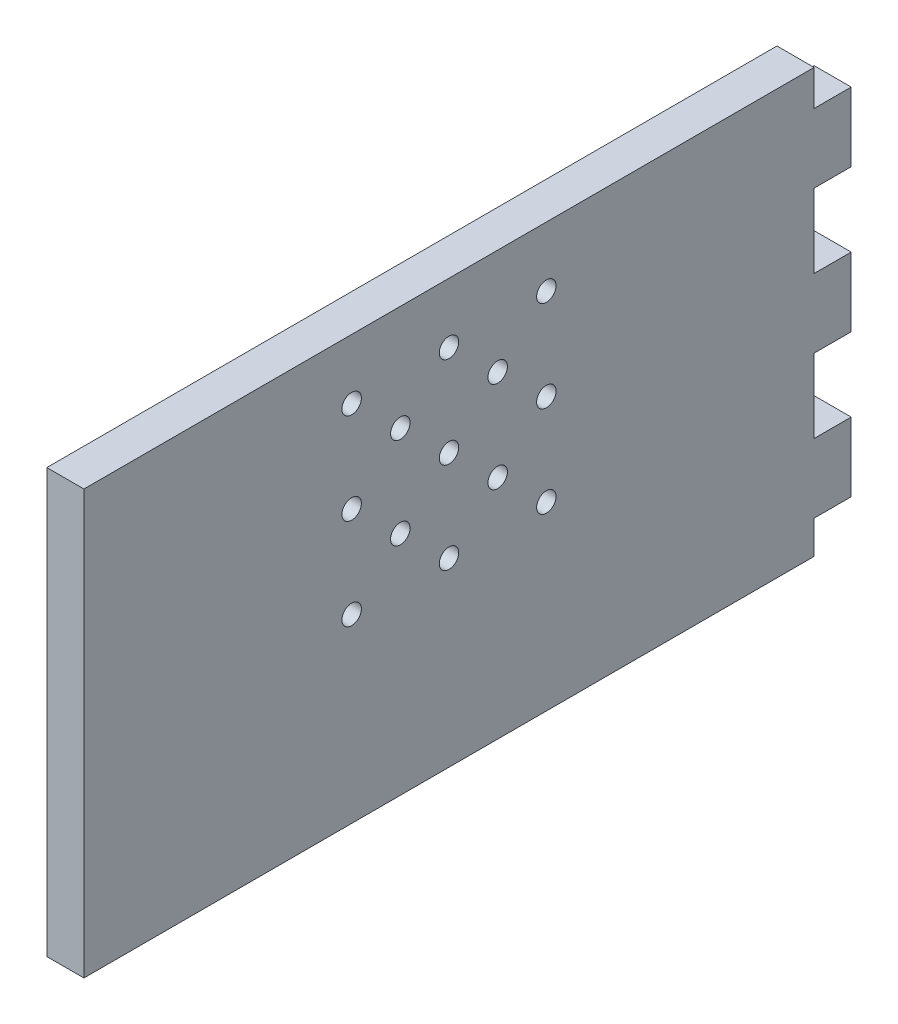
ISO-10303-21;
HEADER;
FILE_DESCRIPTION(('STEP AP214'),'2;1');
FILE_NAME('part.step','',(''),(''),'','','');
FILE_SCHEMA(('AUTOMOTIVE_DESIGN { 1 0 10303 214 1 1 1 1 }'));
ENDSEC;
DATA;
#1=APPLICATION_CONTEXT('core data for automotive mechanical design processes');
#2=APPLICATION_PROTOCOL_DEFINITION('international standard','automotive_design',2000,#1);
#3=PRODUCT_CONTEXT('',#1,'mechanical');
#4=PRODUCT('Part','Part','',(#3));
#5=PRODUCT_RELATED_PRODUCT_CATEGORY('part','',(#4));
#6=PRODUCT_DEFINITION_FORMATION('','',#4);
#7=PRODUCT_DEFINITION_CONTEXT('part definition',#1,'design');
#8=PRODUCT_DEFINITION('design','',#6,#7);
#9=PRODUCT_DEFINITION_SHAPE('','',#8);
#10=(LENGTH_UNIT() NAMED_UNIT(*) SI_UNIT(.MILLI.,.METRE.));
#11=(NAMED_UNIT(*) PLANE_ANGLE_UNIT() SI_UNIT($,.RADIAN.));
#12=(NAMED_UNIT(*) SI_UNIT($,.STERADIAN.) SOLID_ANGLE_UNIT());
#13=UNCERTAINTY_MEASURE_WITH_UNIT(LENGTH_MEASURE(1.E-05),#10,'distance_accuracy_value','');
#14=(GEOMETRIC_REPRESENTATION_CONTEXT(3) GLOBAL_UNCERTAINTY_ASSIGNED_CONTEXT((#13)) GLOBAL_UNIT_ASSIGNED_CONTEXT((#10,
#11,#12)) REPRESENTATION_CONTEXT('',''));
#15=CARTESIAN_POINT('',(0.,0.,0.));
#16=DIRECTION('',(0.,0.,1.));
#17=DIRECTION('',(1.,0.,0.));
#18=AXIS2_PLACEMENT_3D('',#15,#16,#17);
#19=CARTESIAN_POINT('',(0.,0.,0.));
#20=DIRECTION('',(0.,0.,-1.));
#21=DIRECTION('',(-1.,0.,0.));
#22=AXIS2_PLACEMENT_3D('',#19,#20,#21);
#23=PLANE('',#22);
#24=DIRECTION('',(1.,0.,0.));
#25=VECTOR('',#24,1.);
#26=CARTESIAN_POINT('',(450.,38.0281503431067,0.));
#27=LINE('',#26,#25);
#28=CARTESIAN_POINT('',(450.,38.0281503431067,0.));
#29=VERTEX_POINT('',#28);
#30=CARTESIAN_POINT('',(465.25,38.0281503431067,0.));
#31=VERTEX_POINT('',#30);
#32=EDGE_CURVE('E178',#29,#31,#27,.T.);
#33=ORIENTED_EDGE('',*,*,#32,.F.);
#34=DIRECTION('',(0.,-1.,0.));
#35=VECTOR('',#34,1.);
#36=CARTESIAN_POINT('',(450.,170.063864628821,0.));
#37=LINE('',#36,#35);
#38=CARTESIAN_POINT('',(450.,68.3852932002495,0.));
#39=VERTEX_POINT('',#38);
#40=EDGE_CURVE('E294',#39,#29,#37,.T.);
#41=ORIENTED_EDGE('',*,*,#40,.F.);
#42=DIRECTION('',(1.,0.,0.));
#43=VECTOR('',#42,1.);
#44=CARTESIAN_POINT('',(450.,68.3852932002495,0.));
#45=LINE('',#44,#43);
#46=CARTESIAN_POINT('',(465.25,68.3852932002495,0.));
#47=VERTEX_POINT('',#46);
#48=EDGE_CURVE('E190',#39,#47,#45,.T.);
#49=ORIENTED_EDGE('',*,*,#48,.T.);
#50=DIRECTION('',(0.,1.,0.));
#51=VECTOR('',#50,1.);
#52=CARTESIAN_POINT('',(465.25,170.063864628821,0.));
#53=LINE('',#52,#51);
#54=EDGE_CURVE('E242',#31,#47,#53,.T.);
#55=ORIENTED_EDGE('',*,*,#54,.F.);
#56=EDGE_LOOP('',(#33,#41,#49,#55));
#57=FACE_BOUND('',#56,.T.);
#58=ADVANCED_FACE('F34',(#57),#23,.T.);
#59=DIRECTION('',(1.,0.,0.));
#60=VECTOR('',#59,1.);
#61=CARTESIAN_POINT('',(450.,96.7424360573924,0.));
#62=LINE('',#61,#60);
#63=CARTESIAN_POINT('',(450.,96.7424360573924,0.));
#64=VERTEX_POINT('',#63);
#65=CARTESIAN_POINT('',(465.25,96.7424360573924,0.));
#66=VERTEX_POINT('',#65);
#67=EDGE_CURVE('E198',#64,#66,#62,.T.);
#68=ORIENTED_EDGE('',*,*,#67,.F.);
#69=CARTESIAN_POINT('',(450.,127.099578914535,0.));
#70=VERTEX_POINT('',#69);
#71=EDGE_CURVE('E250',#70,#64,#37,.T.);
#72=ORIENTED_EDGE('',*,*,#71,.F.);
#73=DIRECTION('',(1.,0.,0.));
#74=VECTOR('',#73,1.);
#75=CARTESIAN_POINT('',(450.,127.099578914535,0.));
#76=LINE('',#75,#74);
#77=CARTESIAN_POINT('',(465.25,127.099578914535,0.));
#78=VERTEX_POINT('',#77);
#79=EDGE_CURVE('E216',#70,#78,#76,.T.);
#80=ORIENTED_EDGE('',*,*,#79,.T.);
#81=EDGE_CURVE('E303',#66,#78,#53,.T.);
#82=ORIENTED_EDGE('',*,*,#81,.F.);
#83=EDGE_LOOP('',(#68,#72,#80,#82));
#84=FACE_BOUND('',#83,.T.);
#85=ADVANCED_FACE('F301',(#84),#23,.T.);
#86=DIRECTION('',(1.,0.,0.));
#87=VECTOR('',#86,1.);
#88=CARTESIAN_POINT('',(450.,9.67100748596381,0.));
#89=LINE('',#88,#87);
#90=CARTESIAN_POINT('',(450.,9.67100748596381,0.));
#91=VERTEX_POINT('',#90);
#92=CARTESIAN_POINT('',(465.25,9.67100748596381,0.));
#93=VERTEX_POINT('',#92);
#94=EDGE_CURVE('E157',#91,#93,#89,.T.);
#95=ORIENTED_EDGE('',*,*,#94,.T.);
#96=CARTESIAN_POINT('',(465.25,-3.93613537117914,0.));
#97=VERTEX_POINT('',#96);
#98=EDGE_CURVE('E238',#97,#93,#53,.T.);
#99=ORIENTED_EDGE('',*,*,#98,.F.);
#100=DIRECTION('',(1.,0.,0.));
#101=VECTOR('',#100,1.);
#102=CARTESIAN_POINT('',(465.25,-3.93613537117914,0.));
#103=LINE('',#102,#101);
#104=CARTESIAN_POINT('',(450.,-3.93613537117912,0.));
#105=VERTEX_POINT('',#104);
#106=EDGE_CURVE('E249',#105,#97,#103,.T.);
#107=ORIENTED_EDGE('',*,*,#106,.F.);
#108=EDGE_CURVE('E245',#91,#105,#37,.T.);
#109=ORIENTED_EDGE('',*,*,#108,.F.);
#110=EDGE_LOOP('',(#95,#99,#107,#109));
#111=FACE_BOUND('',#110,.T.);
#112=ADVANCED_FACE('F286',(#111),#23,.T.);
#113=CARTESIAN_POINT('',(465.25,170.063864628821,474.667004611632));
#114=DIRECTION('',(-1.,0.,0.));
#115=DIRECTION('',(0.,0.,1.));
#116=AXIS2_PLACEMENT_3D('',#113,#114,#115);
#117=PLANE('',#116);
#118=CARTESIAN_POINT('',(465.25,70.4567217716781,110.));
#119=DIRECTION('',(1.,0.,0.));
#120=DIRECTION('',(0.,0.,-1.));
#121=AXIS2_PLACEMENT_3D('',#118,#119,#120);
#122=CIRCLE('',#121,4.00000000000001);
#123=CARTESIAN_POINT('',(465.25,70.4567217716781,106.));
#124=VERTEX_POINT('',#123);
#125=EDGE_CURVE('E347',#124,#124,#122,.T.);
#126=ORIENTED_EDGE('',*,*,#125,.F.);
#127=EDGE_LOOP('',(#126));
#128=FACE_BOUND('',#127,.T.);
#129=CARTESIAN_POINT('',(465.25,70.4567217716781,150.));
#130=DIRECTION('',(1.,0.,0.));
#131=DIRECTION('',(0.,0.,-1.));
#132=AXIS2_PLACEMENT_3D('',#129,#130,#131);
#133=CIRCLE('',#132,3.99999999999999);
#134=CARTESIAN_POINT('',(465.25,70.4567217716781,146.));
#135=VERTEX_POINT('',#134);
#136=EDGE_CURVE('E351',#135,#135,#133,.T.);
#137=ORIENTED_EDGE('',*,*,#136,.F.);
#138=EDGE_LOOP('',(#137));
#139=FACE_BOUND('',#138,.T.);
#140=CARTESIAN_POINT('',(465.25,126.706721771678,130.));
#141=DIRECTION('',(1.,0.,0.));
#142=DIRECTION('',(0.,0.,-1.));
#143=AXIS2_PLACEMENT_3D('',#140,#141,#142);
#144=CIRCLE('',#143,3.99999999999999);
#145=CARTESIAN_POINT('',(465.25,126.706721771678,126.));
#146=VERTEX_POINT('',#145);
#147=EDGE_CURVE('E355',#146,#146,#144,.T.);
#148=ORIENTED_EDGE('',*,*,#147,.F.);
#149=EDGE_LOOP('',(#148));
#150=FACE_BOUND('',#149,.T.);
#151=CARTESIAN_POINT('',(465.25,145.456721771678,150.));
#152=DIRECTION('',(1.,0.,0.));
#153=DIRECTION('',(0.,0.,-1.));
#154=AXIS2_PLACEMENT_3D('',#151,#152,#153);
#155=CIRCLE('',#154,3.99999999999999);
#156=CARTESIAN_POINT('',(465.25,145.456721771678,146.));
#157=VERTEX_POINT('',#156);
#158=EDGE_CURVE('E359',#157,#157,#155,.T.);
#159=ORIENTED_EDGE('',*,*,#158,.F.);
#160=EDGE_LOOP('',(#159));
#161=FACE_BOUND('',#160,.T.);
#162=CARTESIAN_POINT('',(465.25,145.456721771678,190.));
#163=DIRECTION('',(1.,0.,0.));
#164=DIRECTION('',(0.,0.,-1.));
#165=AXIS2_PLACEMENT_3D('',#162,#163,#164);
#166=CIRCLE('',#165,3.99999999999999);
#167=CARTESIAN_POINT('',(465.25,145.456721771678,186.));
#168=VERTEX_POINT('',#167);
#169=EDGE_CURVE('E363',#168,#168,#166,.T.);
#170=ORIENTED_EDGE('',*,*,#169,.F.);
#171=EDGE_LOOP('',(#170));
#172=FACE_BOUND('',#171,.T.);
#173=CARTESIAN_POINT('',(465.25,126.706721771678,170.));
#174=DIRECTION('',(1.,0.,0.));
#175=DIRECTION('',(0.,0.,-1.));
#176=AXIS2_PLACEMENT_3D('',#173,#174,#175);
#177=CIRCLE('',#176,3.99999999999999);
#178=CARTESIAN_POINT('',(465.25,126.706721771678,166.));
#179=VERTEX_POINT('',#178);
#180=EDGE_CURVE('E367',#179,#179,#177,.T.);
#181=ORIENTED_EDGE('',*,*,#180,.F.);
#182=EDGE_LOOP('',(#181));
#183=FACE_BOUND('',#182,.T.);
#184=CARTESIAN_POINT('',(465.25,70.4567217716781,190.));
#185=DIRECTION('',(1.,0.,0.));
#186=DIRECTION('',(0.,0.,-1.));
#187=AXIS2_PLACEMENT_3D('',#184,#185,#186);
#188=CIRCLE('',#187,3.99999999999999);
#189=CARTESIAN_POINT('',(465.25,70.4567217716781,186.));
#190=VERTEX_POINT('',#189);
#191=EDGE_CURVE('E371',#190,#190,#188,.T.);
#192=ORIENTED_EDGE('',*,*,#191,.F.);
#193=EDGE_LOOP('',(#192));
#194=FACE_BOUND('',#193,.T.);
#195=CARTESIAN_POINT('',(465.25,107.956721771678,190.));
#196=DIRECTION('',(1.,0.,0.));
#197=DIRECTION('',(0.,0.,-1.));
#198=AXIS2_PLACEMENT_3D('',#195,#196,#197);
#199=CIRCLE('',#198,3.99999999999999);
#200=CARTESIAN_POINT('',(465.25,107.956721771678,186.));
#201=VERTEX_POINT('',#200);
#202=EDGE_CURVE('E375',#201,#201,#199,.T.);
#203=ORIENTED_EDGE('',*,*,#202,.F.);
#204=EDGE_LOOP('',(#203));
#205=FACE_BOUND('',#204,.T.);
#206=CARTESIAN_POINT('',(465.25,89.2067217716781,170.));
#207=DIRECTION('',(1.,0.,0.));
#208=DIRECTION('',(0.,0.,-1.));
#209=AXIS2_PLACEMENT_3D('',#206,#207,#208);
#210=CIRCLE('',#209,3.99999999999999);
#211=CARTESIAN_POINT('',(465.25,89.2067217716781,166.));
#212=VERTEX_POINT('',#211);
#213=EDGE_CURVE('E379',#212,#212,#210,.T.);
#214=ORIENTED_EDGE('',*,*,#213,.F.);
#215=EDGE_LOOP('',(#214));
#216=FACE_BOUND('',#215,.T.);
#217=CARTESIAN_POINT('',(465.25,89.2067217716781,130.));
#218=DIRECTION('',(1.,0.,0.));
#219=DIRECTION('',(0.,0.,-1.));
#220=AXIS2_PLACEMENT_3D('',#217,#218,#219);
#221=CIRCLE('',#220,3.99999999999999);
#222=CARTESIAN_POINT('',(465.25,89.2067217716781,126.));
#223=VERTEX_POINT('',#222);
#224=EDGE_CURVE('E383',#223,#223,#221,.T.);
#225=ORIENTED_EDGE('',*,*,#224,.F.);
#226=EDGE_LOOP('',(#225));
#227=FACE_BOUND('',#226,.T.);
#228=CARTESIAN_POINT('',(465.25,107.956721771678,110.));
#229=DIRECTION('',(1.,0.,0.));
#230=DIRECTION('',(0.,0.,-1.));
#231=AXIS2_PLACEMENT_3D('',#228,#229,#230);
#232=CIRCLE('',#231,4.00000000000001);
#233=CARTESIAN_POINT('',(465.25,107.956721771678,106.));
#234=VERTEX_POINT('',#233);
#235=EDGE_CURVE('E387',#234,#234,#232,.T.);
#236=ORIENTED_EDGE('',*,*,#235,.F.);
#237=EDGE_LOOP('',(#236));
#238=FACE_BOUND('',#237,.T.);
#239=CARTESIAN_POINT('',(465.25,107.956721771678,150.));
#240=DIRECTION('',(1.,0.,0.));
#241=DIRECTION('',(0.,0.,-1.));
#242=AXIS2_PLACEMENT_3D('',#239,#240,#241);
#243=CIRCLE('',#242,3.99999999999999);
#244=CARTESIAN_POINT('',(465.25,107.956721771678,146.));
#245=VERTEX_POINT('',#244);
#246=EDGE_CURVE('E391',#245,#245,#243,.T.);
#247=ORIENTED_EDGE('',*,*,#246,.F.);
#248=EDGE_LOOP('',(#247));
#249=FACE_BOUND('',#248,.T.);
#250=CARTESIAN_POINT('',(465.25,145.456721771678,110.));
#251=DIRECTION('',(1.,0.,0.));
#252=DIRECTION('',(0.,0.,-1.));
#253=AXIS2_PLACEMENT_3D('',#250,#251,#252);
#254=CIRCLE('',#253,4.00000000000001);
#255=CARTESIAN_POINT('',(465.25,145.456721771678,106.));
#256=VERTEX_POINT('',#255);
#257=EDGE_CURVE('E394',#256,#256,#254,.T.);
#258=ORIENTED_EDGE('',*,*,#257,.F.);
#259=EDGE_LOOP('',(#258));
#260=FACE_BOUND('',#259,.T.);
#261=DIRECTION('',(0.,1.,0.));
#262=VECTOR('',#261,1.);
#263=CARTESIAN_POINT('',(465.25,170.063864628821,300.));
#264=LINE('',#263,#262);
#265=CARTESIAN_POINT('',(465.25,-3.93613537117913,300.));
#266=VERTEX_POINT('',#265);
#267=CARTESIAN_POINT('',(465.25,170.063864628821,300.));
#268=VERTEX_POINT('',#267);
#269=EDGE_CURVE('E38',#266,#268,#264,.T.);
#270=ORIENTED_EDGE('',*,*,#269,.F.);
#271=DIRECTION('',(0.,0.,-1.));
#272=VECTOR('',#271,1.);
#273=CARTESIAN_POINT('',(465.25,-3.93613537117914,474.667004611632));
#274=LINE('',#273,#272);
#275=EDGE_CURVE('E253',#266,#97,#274,.T.);
#276=ORIENTED_EDGE('',*,*,#275,.T.);
#277=ORIENTED_EDGE('',*,*,#98,.T.);
#278=DIRECTION('',(0.,0.,-1.));
#279=VECTOR('',#278,1.);
#280=CARTESIAN_POINT('',(465.25,9.67100748596381,0.));
#281=LINE('',#280,#279);
#282=CARTESIAN_POINT('',(465.25,9.67100748596381,-15.25));
#283=VERTEX_POINT('',#282);
#284=EDGE_CURVE('E175',#93,#283,#281,.T.);
#285=ORIENTED_EDGE('',*,*,#284,.T.);
#286=DIRECTION('',(0.,1.,0.));
#287=VECTOR('',#286,1.);
#288=CARTESIAN_POINT('',(465.25,38.0281503431067,-15.25));
#289=LINE('',#288,#287);
#290=CARTESIAN_POINT('',(465.25,38.0281503431067,-15.25));
#291=VERTEX_POINT('',#290);
#292=EDGE_CURVE('E153',#283,#291,#289,.T.);
#293=ORIENTED_EDGE('',*,*,#292,.T.);
#294=DIRECTION('',(0.,0.,1.));
#295=VECTOR('',#294,1.);
#296=CARTESIAN_POINT('',(465.25,38.0281503431067,0.));
#297=LINE('',#296,#295);
#298=EDGE_CURVE('E166',#291,#31,#297,.T.);
#299=ORIENTED_EDGE('',*,*,#298,.T.);
#300=ORIENTED_EDGE('',*,*,#54,.T.);
#301=DIRECTION('',(0.,0.,-1.));
#302=VECTOR('',#301,1.);
#303=CARTESIAN_POINT('',(465.25,68.3852932002495,0.));
#304=LINE('',#303,#302);
#305=CARTESIAN_POINT('',(465.25,68.3852932002495,-15.25));
#306=VERTEX_POINT('',#305);
#307=EDGE_CURVE('E180',#47,#306,#304,.T.);
#308=ORIENTED_EDGE('',*,*,#307,.T.);
#309=DIRECTION('',(0.,1.,0.));
#310=VECTOR('',#309,1.);
#311=CARTESIAN_POINT('',(465.25,96.7424360573924,-15.25));
#312=LINE('',#311,#310);
#313=CARTESIAN_POINT('',(465.25,96.7424360573924,-15.25));
#314=VERTEX_POINT('',#313);
#315=EDGE_CURVE('E193',#306,#314,#312,.T.);
#316=ORIENTED_EDGE('',*,*,#315,.T.);
#317=DIRECTION('',(0.,0.,1.));
#318=VECTOR('',#317,1.);
#319=CARTESIAN_POINT('',(465.25,96.7424360573924,0.));
#320=LINE('',#319,#318);
#321=EDGE_CURVE('E185',#314,#66,#320,.T.);
#322=ORIENTED_EDGE('',*,*,#321,.T.);
#323=ORIENTED_EDGE('',*,*,#81,.T.);
#324=DIRECTION('',(0.,0.,-1.));
#325=VECTOR('',#324,1.);
#326=CARTESIAN_POINT('',(465.25,127.099578914535,0.));
#327=LINE('',#326,#325);
#328=CARTESIAN_POINT('',(465.25,127.099578914535,-15.25));
#329=VERTEX_POINT('',#328);
#330=EDGE_CURVE('E200',#78,#329,#327,.T.);
#331=ORIENTED_EDGE('',*,*,#330,.T.);
#332=DIRECTION('',(0.,1.,0.));
#333=VECTOR('',#332,1.);
#334=CARTESIAN_POINT('',(465.25,155.456721771678,-15.25));
#335=LINE('',#334,#333);
#336=CARTESIAN_POINT('',(465.25,155.456721771678,-15.25));
#337=VERTEX_POINT('',#336);
#338=EDGE_CURVE('E219',#329,#337,#335,.T.);
#339=ORIENTED_EDGE('',*,*,#338,.T.);
#340=DIRECTION('',(0.,0.,1.));
#341=VECTOR('',#340,1.);
#342=CARTESIAN_POINT('',(465.25,155.456721771678,0.));
#343=LINE('',#342,#341);
#344=CARTESIAN_POINT('',(465.25,155.456721771678,0.));
#345=VERTEX_POINT('',#344);
#346=EDGE_CURVE('E211',#337,#345,#343,.T.);
#347=ORIENTED_EDGE('',*,*,#346,.T.);
#348=CARTESIAN_POINT('',(465.25,170.063864628821,0.));
#349=VERTEX_POINT('',#348);
#350=EDGE_CURVE('E226',#345,#349,#53,.T.);
#351=ORIENTED_EDGE('',*,*,#350,.T.);
#352=DIRECTION('',(0.,0.,-1.));
#353=VECTOR('',#352,1.);
#354=CARTESIAN_POINT('',(465.25,170.063864628821,474.667004611632));
#355=LINE('',#354,#353);
#356=EDGE_CURVE('E236',#268,#349,#355,.T.);
#357=ORIENTED_EDGE('',*,*,#356,.F.);
#358=EDGE_LOOP('',(#270,#276,#277,#285,#293,#299,#300,#308,#316,#322,#323,#331,#339,#347,#351,#357));
#359=FACE_BOUND('',#358,.T.);
#360=ADVANCED_FACE('F36',(#128,#139,#150,#161,#172,#183,#194,#205,#216,#227,#238,#249,#260,
#359),#117,.F.);
#361=CARTESIAN_POINT('',(465.25,170.063864628821,474.667004611632));
#362=DIRECTION('',(0.,-1.,0.));
#363=DIRECTION('',(0.,0.,-1.));
#364=AXIS2_PLACEMENT_3D('',#361,#362,#363);
#365=PLANE('',#364);
#366=DIRECTION('',(-1.,0.,0.));
#367=VECTOR('',#366,1.);
#368=CARTESIAN_POINT('',(465.25,170.063864628821,300.));
#369=LINE('',#368,#367);
#370=CARTESIAN_POINT('',(450.,170.063864628821,300.));
#371=VERTEX_POINT('',#370);
#372=EDGE_CURVE('E235',#268,#371,#369,.T.);
#373=ORIENTED_EDGE('',*,*,#372,.F.);
#374=ORIENTED_EDGE('',*,*,#356,.T.);
#375=DIRECTION('',(-1.,0.,0.));
#376=VECTOR('',#375,1.);
#377=CARTESIAN_POINT('',(465.25,170.063864628821,0.));
#378=LINE('',#377,#376);
#379=CARTESIAN_POINT('',(450.,170.063864628821,0.));
#380=VERTEX_POINT('',#379);
#381=EDGE_CURVE('E241',#349,#380,#378,.T.);
#382=ORIENTED_EDGE('',*,*,#381,.T.);
#383=DIRECTION('',(0.,0.,-1.));
#384=VECTOR('',#383,1.);
#385=CARTESIAN_POINT('',(450.,170.063864628821,474.667004611632));
#386=LINE('',#385,#384);
#387=EDGE_CURVE('E258',#371,#380,#386,.T.);
#388=ORIENTED_EDGE('',*,*,#387,.F.);
#389=EDGE_LOOP('',(#373,#374,#382,#388));
#390=FACE_BOUND('',#389,.T.);
#391=ADVANCED_FACE('F265',(#390),#365,.F.);
#392=CARTESIAN_POINT('',(450.,170.063864628821,474.667004611632));
#393=DIRECTION('',(1.,0.,0.));
#394=DIRECTION('',(0.,0.,-1.));
#395=AXIS2_PLACEMENT_3D('',#392,#393,#394);
#396=PLANE('',#395);
#397=CARTESIAN_POINT('',(450.,70.4567217716781,110.));
#398=DIRECTION('',(1.,0.,0.));
#399=DIRECTION('',(0.,0.,-1.));
#400=AXIS2_PLACEMENT_3D('',#397,#398,#399);
#401=CIRCLE('',#400,4.00000000000001);
#402=CARTESIAN_POINT('',(450.,70.4567217716781,106.));
#403=VERTEX_POINT('',#402);
#404=EDGE_CURVE('E396',#403,#403,#401,.F.);
#405=ORIENTED_EDGE('',*,*,#404,.F.);
#406=EDGE_LOOP('',(#405));
#407=FACE_BOUND('',#406,.T.);
#408=CARTESIAN_POINT('',(450.,70.4567217716781,150.));
#409=DIRECTION('',(1.,0.,0.));
#410=DIRECTION('',(0.,0.,-1.));
#411=AXIS2_PLACEMENT_3D('',#408,#409,#410);
#412=CIRCLE('',#411,3.99999999999999);
#413=CARTESIAN_POINT('',(450.,70.4567217716781,146.));
#414=VERTEX_POINT('',#413);
#415=EDGE_CURVE('E426',#414,#414,#412,.F.);
#416=ORIENTED_EDGE('',*,*,#415,.F.);
#417=EDGE_LOOP('',(#416));
#418=FACE_BOUND('',#417,.T.);
#419=CARTESIAN_POINT('',(450.,126.706721771678,130.));
#420=DIRECTION('',(1.,0.,0.));
#421=DIRECTION('',(0.,0.,-1.));
#422=AXIS2_PLACEMENT_3D('',#419,#420,#421);
#423=CIRCLE('',#422,3.99999999999999);
#424=CARTESIAN_POINT('',(450.,126.706721771678,126.));
#425=VERTEX_POINT('',#424);
#426=EDGE_CURVE('E422',#425,#425,#423,.F.);
#427=ORIENTED_EDGE('',*,*,#426,.F.);
#428=EDGE_LOOP('',(#427));
#429=FACE_BOUND('',#428,.T.);
#430=CARTESIAN_POINT('',(450.,145.456721771678,150.));
#431=DIRECTION('',(1.,0.,0.));
#432=DIRECTION('',(0.,0.,-1.));
#433=AXIS2_PLACEMENT_3D('',#430,#431,#432);
#434=CIRCLE('',#433,3.99999999999999);
#435=CARTESIAN_POINT('',(450.,145.456721771678,146.));
#436=VERTEX_POINT('',#435);
#437=EDGE_CURVE('E418',#436,#436,#434,.F.);
#438=ORIENTED_EDGE('',*,*,#437,.F.);
#439=EDGE_LOOP('',(#438));
#440=FACE_BOUND('',#439,.T.);
#441=CARTESIAN_POINT('',(450.,145.456721771678,190.));
#442=DIRECTION('',(1.,0.,0.));
#443=DIRECTION('',(0.,0.,-1.));
#444=AXIS2_PLACEMENT_3D('',#441,#442,#443);
#445=CIRCLE('',#444,3.99999999999999);
#446=CARTESIAN_POINT('',(450.,145.456721771678,186.));
#447=VERTEX_POINT('',#446);
#448=EDGE_CURVE('E414',#447,#447,#445,.F.);
#449=ORIENTED_EDGE('',*,*,#448,.F.);
#450=EDGE_LOOP('',(#449));
#451=FACE_BOUND('',#450,.T.);
#452=CARTESIAN_POINT('',(450.,126.706721771678,170.));
#453=DIRECTION('',(1.,0.,0.));
#454=DIRECTION('',(0.,0.,-1.));
#455=AXIS2_PLACEMENT_3D('',#452,#453,#454);
#456=CIRCLE('',#455,3.99999999999999);
#457=CARTESIAN_POINT('',(450.,126.706721771678,166.));
#458=VERTEX_POINT('',#457);
#459=EDGE_CURVE('E410',#458,#458,#456,.F.);
#460=ORIENTED_EDGE('',*,*,#459,.F.);
#461=EDGE_LOOP('',(#460));
#462=FACE_BOUND('',#461,.T.);
#463=CARTESIAN_POINT('',(450.,70.4567217716781,190.));
#464=DIRECTION('',(1.,0.,0.));
#465=DIRECTION('',(0.,0.,-1.));
#466=AXIS2_PLACEMENT_3D('',#463,#464,#465);
#467=CIRCLE('',#466,3.99999999999999);
#468=CARTESIAN_POINT('',(450.,70.4567217716781,186.));
#469=VERTEX_POINT('',#468);
#470=EDGE_CURVE('E406',#469,#469,#467,.F.);
#471=ORIENTED_EDGE('',*,*,#470,.F.);
#472=EDGE_LOOP('',(#471));
#473=FACE_BOUND('',#472,.T.);
#474=CARTESIAN_POINT('',(450.,107.956721771678,190.));
#475=DIRECTION('',(1.,0.,0.));
#476=DIRECTION('',(0.,0.,-1.));
#477=AXIS2_PLACEMENT_3D('',#474,#475,#476);
#478=CIRCLE('',#477,3.99999999999999);
#479=CARTESIAN_POINT('',(450.,107.956721771678,186.));
#480=VERTEX_POINT('',#479);
#481=EDGE_CURVE('E401',#480,#480,#478,.F.);
#482=ORIENTED_EDGE('',*,*,#481,.F.);
#483=EDGE_LOOP('',(#482));
#484=FACE_BOUND('',#483,.T.);
#485=CARTESIAN_POINT('',(450.,89.2067217716781,170.));
#486=DIRECTION('',(1.,0.,0.));
#487=DIRECTION('',(0.,0.,-1.));
#488=AXIS2_PLACEMENT_3D('',#485,#486,#487);
#489=CIRCLE('',#488,3.99999999999999);
#490=CARTESIAN_POINT('',(450.,89.2067217716781,166.));
#491=VERTEX_POINT('',#490);
#492=EDGE_CURVE('E405',#491,#491,#489,.F.);
#493=ORIENTED_EDGE('',*,*,#492,.F.);
#494=EDGE_LOOP('',(#493));
#495=FACE_BOUND('',#494,.T.);
#496=CARTESIAN_POINT('',(450.,89.2067217716781,130.));
#497=DIRECTION('',(1.,0.,0.));
#498=DIRECTION('',(0.,0.,-1.));
#499=AXIS2_PLACEMENT_3D('',#496,#497,#498);
#500=CIRCLE('',#499,3.99999999999999);
#501=CARTESIAN_POINT('',(450.,89.2067217716781,126.));
#502=VERTEX_POINT('',#501);
#503=EDGE_CURVE('E439',#502,#502,#500,.F.);
#504=ORIENTED_EDGE('',*,*,#503,.F.);
#505=EDGE_LOOP('',(#504));
#506=FACE_BOUND('',#505,.T.);
#507=CARTESIAN_POINT('',(450.,107.956721771678,110.));
#508=DIRECTION('',(1.,0.,0.));
#509=DIRECTION('',(0.,0.,-1.));
#510=AXIS2_PLACEMENT_3D('',#507,#508,#509);
#511=CIRCLE('',#510,4.00000000000001);
#512=CARTESIAN_POINT('',(450.,107.956721771678,106.));
#513=VERTEX_POINT('',#512);
#514=EDGE_CURVE('E435',#513,#513,#511,.F.);
#515=ORIENTED_EDGE('',*,*,#514,.F.);
#516=EDGE_LOOP('',(#515));
#517=FACE_BOUND('',#516,.T.);
#518=CARTESIAN_POINT('',(450.,107.956721771678,150.));
#519=DIRECTION('',(1.,0.,0.));
#520=DIRECTION('',(0.,0.,-1.));
#521=AXIS2_PLACEMENT_3D('',#518,#519,#520);
#522=CIRCLE('',#521,3.99999999999999);
#523=CARTESIAN_POINT('',(450.,107.956721771678,146.));
#524=VERTEX_POINT('',#523);
#525=EDGE_CURVE('E431',#524,#524,#522,.F.);
#526=ORIENTED_EDGE('',*,*,#525,.F.);
#527=EDGE_LOOP('',(#526));
#528=FACE_BOUND('',#527,.T.);
#529=CARTESIAN_POINT('',(450.,145.456721771678,110.));
#530=DIRECTION('',(1.,0.,0.));
#531=DIRECTION('',(0.,0.,-1.));
#532=AXIS2_PLACEMENT_3D('',#529,#530,#531);
#533=CIRCLE('',#532,4.00000000000001);
#534=CARTESIAN_POINT('',(450.,145.456721771678,106.));
#535=VERTEX_POINT('',#534);
#536=EDGE_CURVE('E171',#535,#535,#533,.F.);
#537=ORIENTED_EDGE('',*,*,#536,.F.);
#538=EDGE_LOOP('',(#537));
#539=FACE_BOUND('',#538,.T.);
#540=DIRECTION('',(0.,-1.,0.));
#541=VECTOR('',#540,1.);
#542=CARTESIAN_POINT('',(450.,170.063864628821,300.));
#543=LINE('',#542,#541);
#544=CARTESIAN_POINT('',(450.,-3.93613537117912,300.));
#545=VERTEX_POINT('',#544);
#546=EDGE_CURVE('E233',#371,#545,#543,.T.);
#547=ORIENTED_EDGE('',*,*,#546,.F.);
#548=ORIENTED_EDGE('',*,*,#387,.T.);
#549=CARTESIAN_POINT('',(450.,155.456721771678,0.));
#550=VERTEX_POINT('',#549);
#551=EDGE_CURVE('E246',#380,#550,#37,.T.);
#552=ORIENTED_EDGE('',*,*,#551,.T.);
#553=DIRECTION('',(0.,0.,1.));
#554=VECTOR('',#553,1.);
#555=CARTESIAN_POINT('',(450.,155.456721771678,0.));
#556=LINE('',#555,#554);
#557=CARTESIAN_POINT('',(450.,155.456721771678,-15.25));
#558=VERTEX_POINT('',#557);
#559=EDGE_CURVE('E214',#558,#550,#556,.T.);
#560=ORIENTED_EDGE('',*,*,#559,.F.);
#561=DIRECTION('',(0.,1.,0.));
#562=VECTOR('',#561,1.);
#563=CARTESIAN_POINT('',(450.,155.456721771678,-15.25));
#564=LINE('',#563,#562);
#565=CARTESIAN_POINT('',(450.,127.099578914535,-15.25));
#566=VERTEX_POINT('',#565);
#567=EDGE_CURVE('E210',#566,#558,#564,.T.);
#568=ORIENTED_EDGE('',*,*,#567,.F.);
#569=DIRECTION('',(0.,0.,-1.));
#570=VECTOR('',#569,1.);
#571=CARTESIAN_POINT('',(450.,127.099578914535,0.));
#572=LINE('',#571,#570);
#573=EDGE_CURVE('E207',#70,#566,#572,.T.);
#574=ORIENTED_EDGE('',*,*,#573,.F.);
#575=ORIENTED_EDGE('',*,*,#71,.T.);
#576=DIRECTION('',(0.,0.,1.));
#577=VECTOR('',#576,1.);
#578=CARTESIAN_POINT('',(450.,96.7424360573924,0.));
#579=LINE('',#578,#577);
#580=CARTESIAN_POINT('',(450.,96.7424360573924,-15.25));
#581=VERTEX_POINT('',#580);
#582=EDGE_CURVE('E188',#581,#64,#579,.T.);
#583=ORIENTED_EDGE('',*,*,#582,.F.);
#584=DIRECTION('',(0.,1.,0.));
#585=VECTOR('',#584,1.);
#586=CARTESIAN_POINT('',(450.,96.7424360573924,-15.25));
#587=LINE('',#586,#585);
#588=CARTESIAN_POINT('',(450.,68.3852932002495,-15.25));
#589=VERTEX_POINT('',#588);
#590=EDGE_CURVE('E184',#589,#581,#587,.T.);
#591=ORIENTED_EDGE('',*,*,#590,.F.);
#592=DIRECTION('',(0.,0.,-1.));
#593=VECTOR('',#592,1.);
#594=CARTESIAN_POINT('',(450.,68.3852932002495,0.));
#595=LINE('',#594,#593);
#596=EDGE_CURVE('E56',#39,#589,#595,.T.);
#597=ORIENTED_EDGE('',*,*,#596,.F.);
#598=ORIENTED_EDGE('',*,*,#40,.T.);
#599=DIRECTION('',(0.,0.,1.));
#600=VECTOR('',#599,1.);
#601=CARTESIAN_POINT('',(450.,38.0281503431067,0.));
#602=LINE('',#601,#600);
#603=CARTESIAN_POINT('',(450.,38.0281503431067,-15.25));
#604=VERTEX_POINT('',#603);
#605=EDGE_CURVE('E161',#604,#29,#602,.T.);
#606=ORIENTED_EDGE('',*,*,#605,.F.);
#607=DIRECTION('',(0.,1.,0.));
#608=VECTOR('',#607,1.);
#609=CARTESIAN_POINT('',(450.,38.0281503431067,-15.25));
#610=LINE('',#609,#608);
#611=CARTESIAN_POINT('',(450.,9.67100748596381,-15.25));
#612=VERTEX_POINT('',#611);
#613=EDGE_CURVE('E150',#612,#604,#610,.T.);
#614=ORIENTED_EDGE('',*,*,#613,.F.);
#615=DIRECTION('',(0.,0.,-1.));
#616=VECTOR('',#615,1.);
#617=CARTESIAN_POINT('',(450.,9.67100748596381,0.));
#618=LINE('',#617,#616);
#619=EDGE_CURVE('E49',#91,#612,#618,.T.);
#620=ORIENTED_EDGE('',*,*,#619,.F.);
#621=ORIENTED_EDGE('',*,*,#108,.T.);
#622=DIRECTION('',(0.,0.,-1.));
#623=VECTOR('',#622,1.);
#624=CARTESIAN_POINT('',(450.,-3.93613537117912,474.667004611632));
#625=LINE('',#624,#623);
#626=EDGE_CURVE('E255',#545,#105,#625,.T.);
#627=ORIENTED_EDGE('',*,*,#626,.F.);
#628=EDGE_LOOP('',(#547,#548,#552,#560,#568,#574,#575,#583,#591,#597,#598,#606,#614,#620,#621,#627));
#629=FACE_BOUND('',#628,.T.);
#630=ADVANCED_FACE('F160',(#407,#418,#429,#440,#451,#462,#473,#484,#495,#506,#517,#528,#539,
#629),#396,.F.);
#631=CARTESIAN_POINT('',(465.25,-3.93613537117914,474.667004611632));
#632=DIRECTION('',(0.,1.,0.));
#633=DIRECTION('',(-1.,0.,0.));
#634=AXIS2_PLACEMENT_3D('',#631,#632,#633);
#635=PLANE('',#634);
#636=DIRECTION('',(1.,0.,0.));
#637=VECTOR('',#636,1.);
#638=CARTESIAN_POINT('',(465.25,-3.93613537117914,300.));
#639=LINE('',#638,#637);
#640=EDGE_CURVE('E11',#545,#266,#639,.T.);
#641=ORIENTED_EDGE('',*,*,#640,.F.);
#642=ORIENTED_EDGE('',*,*,#626,.T.);
#643=ORIENTED_EDGE('',*,*,#106,.T.);
#644=ORIENTED_EDGE('',*,*,#275,.F.);
#645=EDGE_LOOP('',(#641,#642,#643,#644));
#646=FACE_BOUND('',#645,.T.);
#647=ADVANCED_FACE('F282',(#646),#635,.F.);
#648=DIRECTION('',(1.,0.,0.));
#649=VECTOR('',#648,1.);
#650=CARTESIAN_POINT('',(450.,155.456721771678,0.));
#651=LINE('',#650,#649);
#652=EDGE_CURVE('E224',#550,#345,#651,.T.);
#653=ORIENTED_EDGE('',*,*,#652,.F.);
#654=ORIENTED_EDGE('',*,*,#551,.F.);
#655=ORIENTED_EDGE('',*,*,#381,.F.);
#656=ORIENTED_EDGE('',*,*,#350,.F.);
#657=EDGE_LOOP('',(#653,#654,#655,#656));
#658=FACE_BOUND('',#657,.T.);
#659=ADVANCED_FACE('F273',(#658),#23,.T.);
#660=CARTESIAN_POINT('',(465.25,-20.186135371179,300.));
#661=DIRECTION('',(0.,0.,1.));
#662=DIRECTION('',(1.,0.,0.));
#663=AXIS2_PLACEMENT_3D('',#660,#661,#662);
#664=PLANE('',#663);
#665=ORIENTED_EDGE('',*,*,#372,.T.);
#666=ORIENTED_EDGE('',*,*,#546,.T.);
#667=ORIENTED_EDGE('',*,*,#640,.T.);
#668=ORIENTED_EDGE('',*,*,#269,.T.);
#669=EDGE_LOOP('',(#665,#666,#667,#668));
#670=FACE_BOUND('',#669,.T.);
#671=ADVANCED_FACE('F279',(#670),#664,.T.);
#672=CARTESIAN_POINT('',(450.,155.456721771678,0.));
#673=DIRECTION('',(0.,1.,0.));
#674=DIRECTION('',(0.,0.,1.));
#675=AXIS2_PLACEMENT_3D('',#672,#673,#674);
#676=PLANE('',#675);
#677=ORIENTED_EDGE('',*,*,#346,.F.);
#678=DIRECTION('',(1.,0.,0.));
#679=VECTOR('',#678,1.);
#680=CARTESIAN_POINT('',(450.,155.456721771678,-15.25));
#681=LINE('',#680,#679);
#682=EDGE_CURVE('E227',#558,#337,#681,.T.);
#683=ORIENTED_EDGE('',*,*,#682,.F.);
#684=ORIENTED_EDGE('',*,*,#559,.T.);
#685=ORIENTED_EDGE('',*,*,#652,.T.);
#686=EDGE_LOOP('',(#677,#683,#684,#685));
#687=FACE_BOUND('',#686,.T.);
#688=ADVANCED_FACE('F335',(#687),#676,.T.);
#689=CARTESIAN_POINT('',(450.,155.456721771678,-15.25));
#690=DIRECTION('',(0.,0.,-1.));
#691=DIRECTION('',(0.,1.,0.));
#692=AXIS2_PLACEMENT_3D('',#689,#690,#691);
#693=PLANE('',#692);
#694=ORIENTED_EDGE('',*,*,#338,.F.);
#695=DIRECTION('',(1.,0.,0.));
#696=VECTOR('',#695,1.);
#697=CARTESIAN_POINT('',(450.,127.099578914535,-15.25));
#698=LINE('',#697,#696);
#699=EDGE_CURVE('E229',#566,#329,#698,.T.);
#700=ORIENTED_EDGE('',*,*,#699,.F.);
#701=ORIENTED_EDGE('',*,*,#567,.T.);
#702=ORIENTED_EDGE('',*,*,#682,.T.);
#703=EDGE_LOOP('',(#694,#700,#701,#702));
#704=FACE_BOUND('',#703,.T.);
#705=ADVANCED_FACE('F488',(#704),#693,.T.);
#706=CARTESIAN_POINT('',(450.,127.099578914535,0.));
#707=DIRECTION('',(0.,-1.,0.));
#708=DIRECTION('',(0.,0.,-1.));
#709=AXIS2_PLACEMENT_3D('',#706,#707,#708);
#710=PLANE('',#709);
#711=ORIENTED_EDGE('',*,*,#330,.F.);
#712=ORIENTED_EDGE('',*,*,#79,.F.);
#713=ORIENTED_EDGE('',*,*,#573,.T.);
#714=ORIENTED_EDGE('',*,*,#699,.T.);
#715=EDGE_LOOP('',(#711,#712,#713,#714));
#716=FACE_BOUND('',#715,.T.);
#717=ADVANCED_FACE('F484',(#716),#710,.T.);
#718=CARTESIAN_POINT('',(450.,96.7424360573924,0.));
#719=DIRECTION('',(0.,1.,0.));
#720=DIRECTION('',(0.,0.,1.));
#721=AXIS2_PLACEMENT_3D('',#718,#719,#720);
#722=PLANE('',#721);
#723=ORIENTED_EDGE('',*,*,#321,.F.);
#724=DIRECTION('',(1.,0.,0.));
#725=VECTOR('',#724,1.);
#726=CARTESIAN_POINT('',(450.,96.7424360573924,-15.25));
#727=LINE('',#726,#725);
#728=EDGE_CURVE('E201',#581,#314,#727,.T.);
#729=ORIENTED_EDGE('',*,*,#728,.F.);
#730=ORIENTED_EDGE('',*,*,#582,.T.);
#731=ORIENTED_EDGE('',*,*,#67,.T.);
#732=EDGE_LOOP('',(#723,#729,#730,#731));
#733=FACE_BOUND('',#732,.T.);
#734=ADVANCED_FACE('F306',(#733),#722,.T.);
#735=CARTESIAN_POINT('',(450.,96.7424360573924,-15.25));
#736=DIRECTION('',(0.,0.,-1.));
#737=DIRECTION('',(0.,1.,0.));
#738=AXIS2_PLACEMENT_3D('',#735,#736,#737);
#739=PLANE('',#738);
#740=ORIENTED_EDGE('',*,*,#315,.F.);
#741=DIRECTION('',(1.,0.,0.));
#742=VECTOR('',#741,1.);
#743=CARTESIAN_POINT('',(450.,68.3852932002495,-15.25));
#744=LINE('',#743,#742);
#745=EDGE_CURVE('E203',#589,#306,#744,.T.);
#746=ORIENTED_EDGE('',*,*,#745,.F.);
#747=ORIENTED_EDGE('',*,*,#590,.T.);
#748=ORIENTED_EDGE('',*,*,#728,.T.);
#749=EDGE_LOOP('',(#740,#746,#747,#748));
#750=FACE_BOUND('',#749,.T.);
#751=ADVANCED_FACE('F311',(#750),#739,.T.);
#752=CARTESIAN_POINT('',(450.,68.3852932002495,0.));
#753=DIRECTION('',(0.,-1.,0.));
#754=DIRECTION('',(0.,0.,-1.));
#755=AXIS2_PLACEMENT_3D('',#752,#753,#754);
#756=PLANE('',#755);
#757=ORIENTED_EDGE('',*,*,#307,.F.);
#758=ORIENTED_EDGE('',*,*,#48,.F.);
#759=ORIENTED_EDGE('',*,*,#596,.T.);
#760=ORIENTED_EDGE('',*,*,#745,.T.);
#761=EDGE_LOOP('',(#757,#758,#759,#760));
#762=FACE_BOUND('',#761,.T.);
#763=ADVANCED_FACE('F313',(#762),#756,.T.);
#764=CARTESIAN_POINT('',(450.,38.0281503431067,0.));
#765=DIRECTION('',(0.,1.,0.));
#766=DIRECTION('',(0.,0.,1.));
#767=AXIS2_PLACEMENT_3D('',#764,#765,#766);
#768=PLANE('',#767);
#769=ORIENTED_EDGE('',*,*,#298,.F.);
#770=DIRECTION('',(1.,0.,0.));
#771=VECTOR('',#770,1.);
#772=CARTESIAN_POINT('',(450.,38.0281503431067,-15.25));
#773=LINE('',#772,#771);
#774=EDGE_CURVE('E156',#604,#291,#773,.T.);
#775=ORIENTED_EDGE('',*,*,#774,.F.);
#776=ORIENTED_EDGE('',*,*,#605,.T.);
#777=ORIENTED_EDGE('',*,*,#32,.T.);
#778=EDGE_LOOP('',(#769,#775,#776,#777));
#779=FACE_BOUND('',#778,.T.);
#780=ADVANCED_FACE('F290',(#779),#768,.T.);
#781=CARTESIAN_POINT('',(450.,38.0281503431067,-15.25));
#782=DIRECTION('',(0.,0.,-1.));
#783=DIRECTION('',(0.,1.,0.));
#784=AXIS2_PLACEMENT_3D('',#781,#782,#783);
#785=PLANE('',#784);
#786=ORIENTED_EDGE('',*,*,#292,.F.);
#787=DIRECTION('',(1.,0.,0.));
#788=VECTOR('',#787,1.);
#789=CARTESIAN_POINT('',(450.,9.67100748596381,-15.25));
#790=LINE('',#789,#788);
#791=EDGE_CURVE('E148',#612,#283,#790,.T.);
#792=ORIENTED_EDGE('',*,*,#791,.F.);
#793=ORIENTED_EDGE('',*,*,#613,.T.);
#794=ORIENTED_EDGE('',*,*,#774,.T.);
#795=EDGE_LOOP('',(#786,#792,#793,#794));
#796=FACE_BOUND('',#795,.T.);
#797=ADVANCED_FACE('F149',(#796),#785,.T.);
#798=CARTESIAN_POINT('',(450.,9.67100748596381,0.));
#799=DIRECTION('',(0.,-1.,0.));
#800=DIRECTION('',(0.,0.,-1.));
#801=AXIS2_PLACEMENT_3D('',#798,#799,#800);
#802=PLANE('',#801);
#803=ORIENTED_EDGE('',*,*,#284,.F.);
#804=ORIENTED_EDGE('',*,*,#94,.F.);
#805=ORIENTED_EDGE('',*,*,#619,.T.);
#806=ORIENTED_EDGE('',*,*,#791,.T.);
#807=EDGE_LOOP('',(#803,#804,#805,#806));
#808=FACE_BOUND('',#807,.T.);
#809=ADVANCED_FACE('F163',(#808),#802,.T.);
#810=CARTESIAN_POINT('',(449.999,145.456721771678,110.));
#811=DIRECTION('',(1.,0.,0.));
#812=DIRECTION('',(0.,0.,-1.));
#813=AXIS2_PLACEMENT_3D('',#810,#811,#812);
#814=CYLINDRICAL_SURFACE('',#813,4.00000000000001);
#815=ORIENTED_EDGE('',*,*,#257,.T.);
#816=EDGE_LOOP('',(#815));
#817=FACE_BOUND('',#816,.T.);
#818=ORIENTED_EDGE('',*,*,#536,.T.);
#819=EDGE_LOOP('',(#818));
#820=FACE_BOUND('',#819,.T.);
#821=ADVANCED_FACE('F466',(#817,#820),#814,.F.);
#822=CARTESIAN_POINT('',(449.999,107.956721771678,150.));
#823=DIRECTION('',(1.,0.,0.));
#824=DIRECTION('',(0.,0.,-1.));
#825=AXIS2_PLACEMENT_3D('',#822,#823,#824);
#826=CYLINDRICAL_SURFACE('',#825,3.99999999999999);
#827=ORIENTED_EDGE('',*,*,#246,.T.);
#828=EDGE_LOOP('',(#827));
#829=FACE_BOUND('',#828,.T.);
#830=ORIENTED_EDGE('',*,*,#525,.T.);
#831=EDGE_LOOP('',(#830));
#832=FACE_BOUND('',#831,.T.);
#833=ADVANCED_FACE('F468',(#829,#832),#826,.F.);
#834=CARTESIAN_POINT('',(449.999,107.956721771678,110.));
#835=DIRECTION('',(1.,0.,0.));
#836=DIRECTION('',(0.,0.,-1.));
#837=AXIS2_PLACEMENT_3D('',#834,#835,#836);
#838=CYLINDRICAL_SURFACE('',#837,4.00000000000001);
#839=ORIENTED_EDGE('',*,*,#235,.T.);
#840=EDGE_LOOP('',(#839));
#841=FACE_BOUND('',#840,.T.);
#842=ORIENTED_EDGE('',*,*,#514,.T.);
#843=EDGE_LOOP('',(#842));
#844=FACE_BOUND('',#843,.T.);
#845=ADVANCED_FACE('F474',(#841,#844),#838,.F.);
#846=CARTESIAN_POINT('',(449.999,89.2067217716781,130.));
#847=DIRECTION('',(1.,0.,0.));
#848=DIRECTION('',(0.,0.,-1.));
#849=AXIS2_PLACEMENT_3D('',#846,#847,#848);
#850=CYLINDRICAL_SURFACE('',#849,3.99999999999999);
#851=ORIENTED_EDGE('',*,*,#224,.T.);
#852=EDGE_LOOP('',(#851));
#853=FACE_BOUND('',#852,.T.);
#854=ORIENTED_EDGE('',*,*,#503,.T.);
#855=EDGE_LOOP('',(#854));
#856=FACE_BOUND('',#855,.T.);
#857=ADVANCED_FACE('F450',(#853,#856),#850,.F.);
#858=CARTESIAN_POINT('',(449.999,89.2067217716781,170.));
#859=DIRECTION('',(1.,0.,0.));
#860=DIRECTION('',(0.,0.,-1.));
#861=AXIS2_PLACEMENT_3D('',#858,#859,#860);
#862=CYLINDRICAL_SURFACE('',#861,3.99999999999999);
#863=ORIENTED_EDGE('',*,*,#213,.T.);
#864=EDGE_LOOP('',(#863));
#865=FACE_BOUND('',#864,.T.);
#866=ORIENTED_EDGE('',*,*,#492,.T.);
#867=EDGE_LOOP('',(#866));
#868=FACE_BOUND('',#867,.T.);
#869=ADVANCED_FACE('F446',(#865,#868),#862,.F.);
#870=CARTESIAN_POINT('',(449.999,107.956721771678,190.));
#871=DIRECTION('',(1.,0.,0.));
#872=DIRECTION('',(0.,0.,-1.));
#873=AXIS2_PLACEMENT_3D('',#870,#871,#872);
#874=CYLINDRICAL_SURFACE('',#873,3.99999999999999);
#875=ORIENTED_EDGE('',*,*,#202,.T.);
#876=EDGE_LOOP('',(#875));
#877=FACE_BOUND('',#876,.T.);
#878=ORIENTED_EDGE('',*,*,#481,.T.);
#879=EDGE_LOOP('',(#878));
#880=FACE_BOUND('',#879,.T.);
#881=ADVANCED_FACE('F449',(#877,#880),#874,.F.);
#882=CARTESIAN_POINT('',(449.999,70.4567217716781,190.));
#883=DIRECTION('',(1.,0.,0.));
#884=DIRECTION('',(0.,0.,-1.));
#885=AXIS2_PLACEMENT_3D('',#882,#883,#884);
#886=CYLINDRICAL_SURFACE('',#885,3.99999999999999);
#887=ORIENTED_EDGE('',*,*,#191,.T.);
#888=EDGE_LOOP('',(#887));
#889=FACE_BOUND('',#888,.T.);
#890=ORIENTED_EDGE('',*,*,#470,.T.);
#891=EDGE_LOOP('',(#890));
#892=FACE_BOUND('',#891,.T.);
#893=ADVANCED_FACE('F600',(#889,#892),#886,.F.);
#894=CARTESIAN_POINT('',(449.999,126.706721771678,170.));
#895=DIRECTION('',(1.,0.,0.));
#896=DIRECTION('',(0.,0.,-1.));
#897=AXIS2_PLACEMENT_3D('',#894,#895,#896);
#898=CYLINDRICAL_SURFACE('',#897,3.99999999999999);
#899=ORIENTED_EDGE('',*,*,#180,.T.);
#900=EDGE_LOOP('',(#899));
#901=FACE_BOUND('',#900,.T.);
#902=ORIENTED_EDGE('',*,*,#459,.T.);
#903=EDGE_LOOP('',(#902));
#904=FACE_BOUND('',#903,.T.);
#905=ADVANCED_FACE('F609',(#901,#904),#898,.F.);
#906=CARTESIAN_POINT('',(449.999,145.456721771678,190.));
#907=DIRECTION('',(1.,0.,0.));
#908=DIRECTION('',(0.,0.,-1.));
#909=AXIS2_PLACEMENT_3D('',#906,#907,#908);
#910=CYLINDRICAL_SURFACE('',#909,3.99999999999999);
#911=ORIENTED_EDGE('',*,*,#169,.T.);
#912=EDGE_LOOP('',(#911));
#913=FACE_BOUND('',#912,.T.);
#914=ORIENTED_EDGE('',*,*,#448,.T.);
#915=EDGE_LOOP('',(#914));
#916=FACE_BOUND('',#915,.T.);
#917=ADVANCED_FACE('F618',(#913,#916),#910,.F.);
#918=CARTESIAN_POINT('',(449.999,145.456721771678,150.));
#919=DIRECTION('',(1.,0.,0.));
#920=DIRECTION('',(0.,0.,-1.));
#921=AXIS2_PLACEMENT_3D('',#918,#919,#920);
#922=CYLINDRICAL_SURFACE('',#921,3.99999999999999);
#923=ORIENTED_EDGE('',*,*,#158,.T.);
#924=EDGE_LOOP('',(#923));
#925=FACE_BOUND('',#924,.T.);
#926=ORIENTED_EDGE('',*,*,#437,.T.);
#927=EDGE_LOOP('',(#926));
#928=FACE_BOUND('',#927,.T.);
#929=ADVANCED_FACE('F628',(#925,#928),#922,.F.);
#930=CARTESIAN_POINT('',(449.999,126.706721771678,130.));
#931=DIRECTION('',(1.,0.,0.));
#932=DIRECTION('',(0.,0.,-1.));
#933=AXIS2_PLACEMENT_3D('',#930,#931,#932);
#934=CYLINDRICAL_SURFACE('',#933,3.99999999999999);
#935=ORIENTED_EDGE('',*,*,#147,.T.);
#936=EDGE_LOOP('',(#935));
#937=FACE_BOUND('',#936,.T.);
#938=ORIENTED_EDGE('',*,*,#426,.T.);
#939=EDGE_LOOP('',(#938));
#940=FACE_BOUND('',#939,.T.);
#941=ADVANCED_FACE('F638',(#937,#940),#934,.F.);
#942=CARTESIAN_POINT('',(449.999,70.4567217716781,150.));
#943=DIRECTION('',(1.,0.,0.));
#944=DIRECTION('',(0.,0.,-1.));
#945=AXIS2_PLACEMENT_3D('',#942,#943,#944);
#946=CYLINDRICAL_SURFACE('',#945,3.99999999999999);
#947=ORIENTED_EDGE('',*,*,#136,.T.);
#948=EDGE_LOOP('',(#947));
#949=FACE_BOUND('',#948,.T.);
#950=ORIENTED_EDGE('',*,*,#415,.T.);
#951=EDGE_LOOP('',(#950));
#952=FACE_BOUND('',#951,.T.);
#953=ADVANCED_FACE('F648',(#949,#952),#946,.F.);
#954=CARTESIAN_POINT('',(449.999,70.4567217716781,110.));
#955=DIRECTION('',(1.,0.,0.));
#956=DIRECTION('',(0.,0.,-1.));
#957=AXIS2_PLACEMENT_3D('',#954,#955,#956);
#958=CYLINDRICAL_SURFACE('',#957,4.00000000000001);
#959=ORIENTED_EDGE('',*,*,#125,.T.);
#960=EDGE_LOOP('',(#959));
#961=FACE_BOUND('',#960,.T.);
#962=ORIENTED_EDGE('',*,*,#404,.T.);
#963=EDGE_LOOP('',(#962));
#964=FACE_BOUND('',#963,.T.);
#965=ADVANCED_FACE('F658',(#961,#964),#958,.F.);
#966=CLOSED_SHELL('',(#58,#85,#112,#360,#391,#630,#647,#659,#671,#688,#705,#717,#734,#751,#763,
#780,#797,#809,#821,#833,#845,#857,#869,#881,#893,#905,#917,#929,#941,#953,#965));
#967=MANIFOLD_SOLID_BREP('B2',#966);
#968=ADVANCED_BREP_SHAPE_REPRESENTATION('',(#18,#967),#14);
#969=SHAPE_DEFINITION_REPRESENTATION(#9,#968);
ENDSEC;
END-ISO-10303-21;
